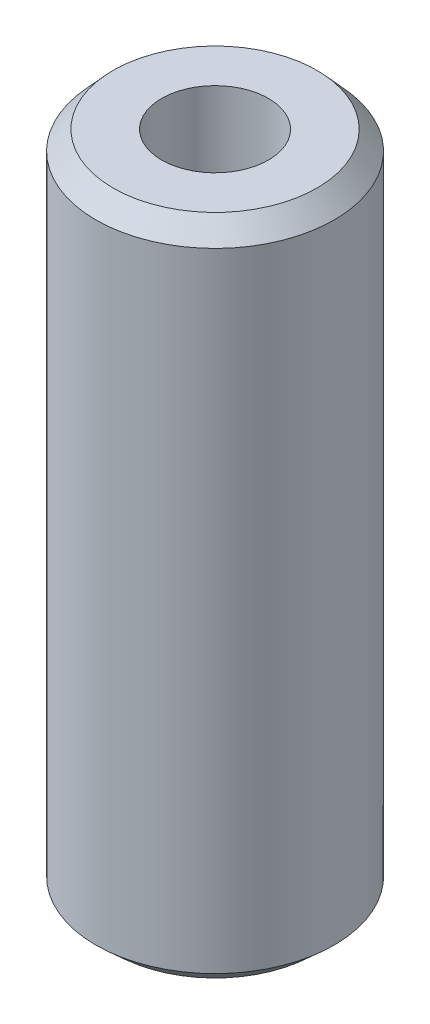
ISO-10303-21;
HEADER;
FILE_DESCRIPTION(('STEP AP214'),'2;1');
FILE_NAME('part.step','',(''),(''),'','','');
FILE_SCHEMA(('AUTOMOTIVE_DESIGN { 1 0 10303 214 1 1 1 1 }'));
ENDSEC;
DATA;
#1=APPLICATION_CONTEXT('core data for automotive mechanical design processes');
#2=APPLICATION_PROTOCOL_DEFINITION('international standard','automotive_design',2000,#1);
#3=PRODUCT_CONTEXT('',#1,'mechanical');
#4=PRODUCT('Part','Part','',(#3));
#5=PRODUCT_RELATED_PRODUCT_CATEGORY('part','',(#4));
#6=PRODUCT_DEFINITION_FORMATION('','',#4);
#7=PRODUCT_DEFINITION_CONTEXT('part definition',#1,'design');
#8=PRODUCT_DEFINITION('design','',#6,#7);
#9=PRODUCT_DEFINITION_SHAPE('','',#8);
#10=(LENGTH_UNIT() NAMED_UNIT(*) SI_UNIT(.MILLI.,.METRE.));
#11=(NAMED_UNIT(*) PLANE_ANGLE_UNIT() SI_UNIT($,.RADIAN.));
#12=(NAMED_UNIT(*) SI_UNIT($,.STERADIAN.) SOLID_ANGLE_UNIT());
#13=UNCERTAINTY_MEASURE_WITH_UNIT(LENGTH_MEASURE(1.E-05),#10,'distance_accuracy_value','');
#14=(GEOMETRIC_REPRESENTATION_CONTEXT(3) GLOBAL_UNCERTAINTY_ASSIGNED_CONTEXT((#13)) GLOBAL_UNIT_ASSIGNED_CONTEXT((#10,
#11,#12)) REPRESENTATION_CONTEXT('',''));
#15=CARTESIAN_POINT('',(0.,0.,0.));
#16=DIRECTION('',(0.,0.,1.));
#17=DIRECTION('',(1.,0.,0.));
#18=AXIS2_PLACEMENT_3D('',#15,#16,#17);
#19=CARTESIAN_POINT('',(0.,55.7509002213117,0.));
#20=DIRECTION('',(0.,-1.,0.));
#21=DIRECTION('',(0.,0.,-1.));
#22=AXIS2_PLACEMENT_3D('',#19,#20,#21);
#23=CYLINDRICAL_SURFACE('',#22,10.);
#24=CARTESIAN_POINT('',(0.,54.1566549979939,0.));
#25=DIRECTION('',(0.,1.,0.));
#26=DIRECTION('',(0.,0.,1.));
#27=AXIS2_PLACEMENT_3D('',#24,#25,#26);
#28=CIRCLE('',#27,10.);
#29=CARTESIAN_POINT('',(0.,54.1566549979939,10.));
#30=VERTEX_POINT('',#29);
#31=EDGE_CURVE('E50',#30,#30,#28,.F.);
#32=ORIENTED_EDGE('',*,*,#31,.T.);
#33=EDGE_LOOP('',(#32));
#34=FACE_BOUND('',#33,.T.);
#35=CARTESIAN_POINT('',(0.,1.44475859803015,0.));
#36=DIRECTION('',(0.,1.,0.));
#37=DIRECTION('',(0.,0.,1.));
#38=AXIS2_PLACEMENT_3D('',#35,#36,#37);
#39=CIRCLE('',#38,10.);
#40=CARTESIAN_POINT('',(0.,1.44475859803015,10.));
#41=VERTEX_POINT('',#40);
#42=EDGE_CURVE('E51',#41,#41,#39,.T.);
#43=ORIENTED_EDGE('',*,*,#42,.T.);
#44=EDGE_LOOP('',(#43));
#45=FACE_BOUND('',#44,.T.);
#46=ADVANCED_FACE('F39',(#34,#45),#23,.T.);
#47=CARTESIAN_POINT('',(0.,55.7509002213117,0.));
#48=DIRECTION('',(0.,1.,0.));
#49=DIRECTION('',(0.,0.,1.));
#50=AXIS2_PLACEMENT_3D('',#47,#48,#49);
#51=PLANE('',#50);
#52=CARTESIAN_POINT('',(0.,55.7509002213117,0.));
#53=DIRECTION('',(0.,1.,0.));
#54=DIRECTION('',(0.,0.,1.));
#55=AXIS2_PLACEMENT_3D('',#52,#53,#54);
#56=CIRCLE('',#55,8.55524140196985);
#57=CARTESIAN_POINT('',(0.,55.7509002213117,8.55524140196985));
#58=VERTEX_POINT('',#57);
#59=EDGE_CURVE('E54',#58,#58,#56,.T.);
#60=ORIENTED_EDGE('',*,*,#59,.T.);
#61=EDGE_LOOP('',(#60));
#62=FACE_BOUND('',#61,.T.);
#63=CARTESIAN_POINT('',(0.,55.7509002213117,0.));
#64=DIRECTION('',(0.,1.,0.));
#65=DIRECTION('',(0.,0.,1.));
#66=AXIS2_PLACEMENT_3D('',#63,#64,#65);
#67=CIRCLE('',#66,4.483063065231);
#68=CARTESIAN_POINT('',(0.,55.7509002213117,4.483063065231));
#69=VERTEX_POINT('',#68);
#70=EDGE_CURVE('E58',#69,#69,#67,.T.);
#71=ORIENTED_EDGE('',*,*,#70,.F.);
#72=EDGE_LOOP('',(#71));
#73=FACE_BOUND('',#72,.T.);
#74=ADVANCED_FACE('F69',(#62,#73),#51,.T.);
#75=CARTESIAN_POINT('',(0.,0.,0.));
#76=DIRECTION('',(0.,1.,0.));
#77=DIRECTION('',(0.,0.,1.));
#78=AXIS2_PLACEMENT_3D('',#75,#76,#77);
#79=PLANE('',#78);
#80=CARTESIAN_POINT('',(0.,0.,0.));
#81=DIRECTION('',(0.,1.,0.));
#82=DIRECTION('',(0.,0.,1.));
#83=AXIS2_PLACEMENT_3D('',#80,#81,#82);
#84=CIRCLE('',#83,8.40575477668225);
#85=CARTESIAN_POINT('',(0.,0.,8.40575477668225));
#86=VERTEX_POINT('',#85);
#87=EDGE_CURVE('E10',#86,#86,#84,.F.);
#88=ORIENTED_EDGE('',*,*,#87,.T.);
#89=EDGE_LOOP('',(#88));
#90=FACE_BOUND('',#89,.T.);
#91=CARTESIAN_POINT('',(0.,0.,0.));
#92=DIRECTION('',(0.,1.,0.));
#93=DIRECTION('',(0.,0.,1.));
#94=AXIS2_PLACEMENT_3D('',#91,#92,#93);
#95=CIRCLE('',#94,4.483063065231);
#96=CARTESIAN_POINT('',(0.,0.,4.483063065231));
#97=VERTEX_POINT('',#96);
#98=EDGE_CURVE('E63',#97,#97,#95,.T.);
#99=ORIENTED_EDGE('',*,*,#98,.T.);
#100=EDGE_LOOP('',(#99));
#101=FACE_BOUND('',#100,.T.);
#102=ADVANCED_FACE('F75',(#90,#101),#79,.F.);
#103=CARTESIAN_POINT('',(0.,55.7509002213117,0.));
#104=DIRECTION('',(0.,-1.,0.));
#105=DIRECTION('',(0.,0.,-1.));
#106=AXIS2_PLACEMENT_3D('',#103,#104,#105);
#107=CYLINDRICAL_SURFACE('',#106,4.483063065231);
#108=ORIENTED_EDGE('',*,*,#70,.T.);
#109=EDGE_LOOP('',(#108));
#110=FACE_BOUND('',#109,.T.);
#111=ORIENTED_EDGE('',*,*,#98,.F.);
#112=EDGE_LOOP('',(#111));
#113=FACE_BOUND('',#112,.T.);
#114=ADVANCED_FACE('F70',(#110,#113),#107,.F.);
#115=CARTESIAN_POINT('',(0.,55.7509002213117,0.));
#116=DIRECTION('',(0.,-1.,0.));
#117=DIRECTION('',(0.,0.,-1.));
#118=AXIS2_PLACEMENT_3D('',#115,#116,#117);
#119=CONICAL_SURFACE('',#118,8.55524140196985,0.736248427747691);
#120=ORIENTED_EDGE('',*,*,#31,.F.);
#121=EDGE_LOOP('',(#120));
#122=FACE_BOUND('',#121,.T.);
#123=ORIENTED_EDGE('',*,*,#59,.F.);
#124=EDGE_LOOP('',(#123));
#125=FACE_BOUND('',#124,.T.);
#126=ADVANCED_FACE('F81',(#122,#125),#119,.T.);
#127=CARTESIAN_POINT('',(0.,1.44475859803015,0.));
#128=DIRECTION('',(0.,1.,0.));
#129=DIRECTION('',(0.,0.,1.));
#130=AXIS2_PLACEMENT_3D('',#127,#128,#129);
#131=CONICAL_SURFACE('',#130,10.,0.834547899047207);
#132=ORIENTED_EDGE('',*,*,#87,.F.);
#133=EDGE_LOOP('',(#132));
#134=FACE_BOUND('',#133,.T.);
#135=ORIENTED_EDGE('',*,*,#42,.F.);
#136=EDGE_LOOP('',(#135));
#137=FACE_BOUND('',#136,.T.);
#138=ADVANCED_FACE('F45',(#134,#137),#131,.T.);
#139=CLOSED_SHELL('',(#46,#74,#102,#114,#126,#138));
#140=MANIFOLD_SOLID_BREP('B2',#139);
#141=ADVANCED_BREP_SHAPE_REPRESENTATION('',(#18,#140),#14);
#142=SHAPE_DEFINITION_REPRESENTATION(#9,#141);
ENDSEC;
END-ISO-10303-21;
